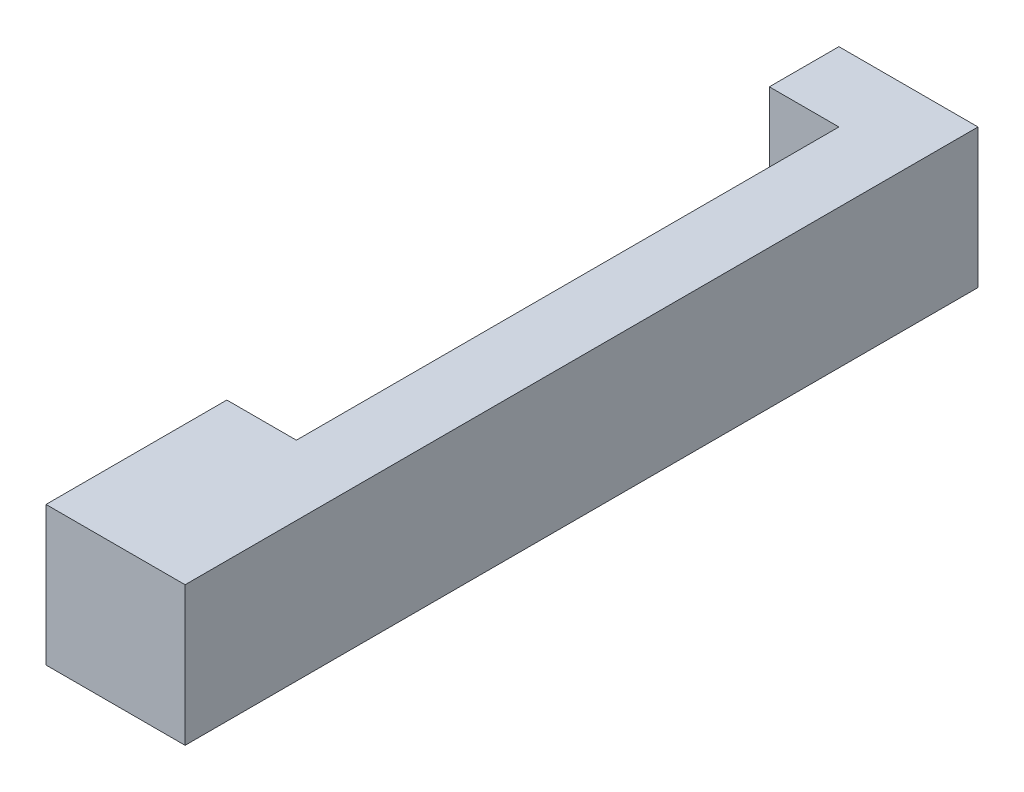
ISO-10303-21;
HEADER;
FILE_DESCRIPTION(('STEP AP214'),'2;1');
FILE_NAME('part.step','',(''),(''),'','','');
FILE_SCHEMA(('AUTOMOTIVE_DESIGN { 1 0 10303 214 1 1 1 1 }'));
ENDSEC;
DATA;
#1=APPLICATION_CONTEXT('core data for automotive mechanical design processes');
#2=APPLICATION_PROTOCOL_DEFINITION('international standard','automotive_design',2000,#1);
#3=PRODUCT_CONTEXT('',#1,'mechanical');
#4=PRODUCT('Part','Part','',(#3));
#5=PRODUCT_RELATED_PRODUCT_CATEGORY('part','',(#4));
#6=PRODUCT_DEFINITION_FORMATION('','',#4);
#7=PRODUCT_DEFINITION_CONTEXT('part definition',#1,'design');
#8=PRODUCT_DEFINITION('design','',#6,#7);
#9=PRODUCT_DEFINITION_SHAPE('','',#8);
#10=(LENGTH_UNIT() NAMED_UNIT(*) SI_UNIT(.MILLI.,.METRE.));
#11=(NAMED_UNIT(*) PLANE_ANGLE_UNIT() SI_UNIT($,.RADIAN.));
#12=(NAMED_UNIT(*) SI_UNIT($,.STERADIAN.) SOLID_ANGLE_UNIT());
#13=UNCERTAINTY_MEASURE_WITH_UNIT(LENGTH_MEASURE(1.E-05),#10,'distance_accuracy_value','');
#14=(GEOMETRIC_REPRESENTATION_CONTEXT(3) GLOBAL_UNCERTAINTY_ASSIGNED_CONTEXT((#13)) GLOBAL_UNIT_ASSIGNED_CONTEXT((#10,
#11,#12)) REPRESENTATION_CONTEXT('',''));
#15=CARTESIAN_POINT('',(0.,0.,0.));
#16=DIRECTION('',(0.,0.,1.));
#17=DIRECTION('',(1.,0.,0.));
#18=AXIS2_PLACEMENT_3D('',#15,#16,#17);
#19=CARTESIAN_POINT('',(0.,25.4,0.));
#20=DIRECTION('',(0.,0.,1.));
#21=DIRECTION('',(1.,0.,0.));
#22=AXIS2_PLACEMENT_3D('',#19,#20,#21);
#23=PLANE('',#22);
#24=DIRECTION('',(-1.,0.,0.));
#25=VECTOR('',#24,1.);
#26=CARTESIAN_POINT('',(0.,0.,0.));
#27=LINE('',#26,#25);
#28=CARTESIAN_POINT('',(0.,0.,0.));
#29=VERTEX_POINT('',#28);
#30=CARTESIAN_POINT('',(-25.4,0.,0.));
#31=VERTEX_POINT('',#30);
#32=EDGE_CURVE('E179',#29,#31,#27,.T.);
#33=ORIENTED_EDGE('',*,*,#32,.F.);
#34=DIRECTION('',(0.,-1.,0.));
#35=VECTOR('',#34,1.);
#36=CARTESIAN_POINT('',(0.,25.4,0.));
#37=LINE('',#36,#35);
#38=CARTESIAN_POINT('',(0.,25.4,0.));
#39=VERTEX_POINT('',#38);
#40=EDGE_CURVE('E154',#39,#29,#37,.T.);
#41=ORIENTED_EDGE('',*,*,#40,.F.);
#42=DIRECTION('',(-1.,0.,0.));
#43=VECTOR('',#42,1.);
#44=CARTESIAN_POINT('',(0.,25.4,0.));
#45=LINE('',#44,#43);
#46=CARTESIAN_POINT('',(-25.4,25.4,0.));
#47=VERTEX_POINT('',#46);
#48=EDGE_CURVE('E199',#39,#47,#45,.T.);
#49=ORIENTED_EDGE('',*,*,#48,.T.);
#50=DIRECTION('',(0.,-1.,0.));
#51=VECTOR('',#50,1.);
#52=CARTESIAN_POINT('',(-25.4,25.4,0.));
#53=LINE('',#52,#51);
#54=EDGE_CURVE('E86',#47,#31,#53,.T.);
#55=ORIENTED_EDGE('',*,*,#54,.T.);
#56=EDGE_LOOP('',(#33,#41,#49,#55));
#57=FACE_BOUND('',#56,.T.);
#58=ADVANCED_FACE('F75',(#57),#23,.T.);
#59=CARTESIAN_POINT('',(0.,25.4,0.));
#60=DIRECTION('',(-1.,0.,0.));
#61=DIRECTION('',(0.,0.,1.));
#62=AXIS2_PLACEMENT_3D('',#59,#60,#61);
#63=PLANE('',#62);
#64=DIRECTION('',(0.,0.,-1.));
#65=VECTOR('',#64,1.);
#66=CARTESIAN_POINT('',(0.,0.,0.));
#67=LINE('',#66,#65);
#68=CARTESIAN_POINT('',(0.,0.,-144.78));
#69=VERTEX_POINT('',#68);
#70=EDGE_CURVE('E128',#29,#69,#67,.T.);
#71=ORIENTED_EDGE('',*,*,#70,.T.);
#72=DIRECTION('',(0.,-1.,0.));
#73=VECTOR('',#72,1.);
#74=CARTESIAN_POINT('',(0.,25.4,-144.78));
#75=LINE('',#74,#73);
#76=CARTESIAN_POINT('',(0.,25.4,-144.78));
#77=VERTEX_POINT('',#76);
#78=EDGE_CURVE('E122',#77,#69,#75,.T.);
#79=ORIENTED_EDGE('',*,*,#78,.F.);
#80=DIRECTION('',(0.,0.,-1.));
#81=VECTOR('',#80,1.);
#82=CARTESIAN_POINT('',(0.,25.4,0.));
#83=LINE('',#82,#81);
#84=EDGE_CURVE('E195',#39,#77,#83,.T.);
#85=ORIENTED_EDGE('',*,*,#84,.F.);
#86=ORIENTED_EDGE('',*,*,#40,.T.);
#87=EDGE_LOOP('',(#71,#79,#85,#86));
#88=FACE_BOUND('',#87,.T.);
#89=ADVANCED_FACE('F230',(#88),#63,.F.);
#90=CARTESIAN_POINT('',(0.,25.4,-144.78));
#91=DIRECTION('',(0.,0.,1.));
#92=DIRECTION('',(1.,0.,0.));
#93=AXIS2_PLACEMENT_3D('',#90,#91,#92);
#94=PLANE('',#93);
#95=DIRECTION('',(-1.,0.,0.));
#96=VECTOR('',#95,1.);
#97=CARTESIAN_POINT('',(0.,0.,-144.78));
#98=LINE('',#97,#96);
#99=CARTESIAN_POINT('',(-25.4,0.,-144.78));
#100=VERTEX_POINT('',#99);
#101=EDGE_CURVE('E114',#69,#100,#98,.T.);
#102=ORIENTED_EDGE('',*,*,#101,.T.);
#103=DIRECTION('',(0.,-1.,0.));
#104=VECTOR('',#103,1.);
#105=CARTESIAN_POINT('',(-25.4,25.4,-144.78));
#106=LINE('',#105,#104);
#107=CARTESIAN_POINT('',(-25.4,25.4,-144.78));
#108=VERTEX_POINT('',#107);
#109=EDGE_CURVE('E118',#108,#100,#106,.T.);
#110=ORIENTED_EDGE('',*,*,#109,.F.);
#111=DIRECTION('',(-1.,0.,0.));
#112=VECTOR('',#111,1.);
#113=CARTESIAN_POINT('',(0.,25.4,-144.78));
#114=LINE('',#113,#112);
#115=EDGE_CURVE('E192',#77,#108,#114,.T.);
#116=ORIENTED_EDGE('',*,*,#115,.F.);
#117=ORIENTED_EDGE('',*,*,#78,.T.);
#118=EDGE_LOOP('',(#102,#110,#116,#117));
#119=FACE_BOUND('',#118,.T.);
#120=ADVANCED_FACE('F116',(#119),#94,.F.);
#121=CARTESIAN_POINT('',(-12.7,25.4,0.));
#122=DIRECTION('',(-1.,0.,0.));
#123=DIRECTION('',(0.,0.,1.));
#124=AXIS2_PLACEMENT_3D('',#121,#122,#123);
#125=PLANE('',#124);
#126=DIRECTION('',(0.,1.,0.));
#127=VECTOR('',#126,1.);
#128=CARTESIAN_POINT('',(-12.7,25.4,-132.08));
#129=LINE('',#128,#127);
#130=CARTESIAN_POINT('',(-12.7,0.,-132.08));
#131=VERTEX_POINT('',#130);
#132=CARTESIAN_POINT('',(-12.7,25.4,-132.08));
#133=VERTEX_POINT('',#132);
#134=EDGE_CURVE('E12',#131,#133,#129,.T.);
#135=ORIENTED_EDGE('',*,*,#134,.F.);
#136=DIRECTION('',(0.,0.,-1.));
#137=VECTOR('',#136,1.);
#138=CARTESIAN_POINT('',(-12.7,0.,0.));
#139=LINE('',#138,#137);
#140=CARTESIAN_POINT('',(-12.7,0.,-33.02));
#141=VERTEX_POINT('',#140);
#142=EDGE_CURVE('E127',#141,#131,#139,.T.);
#143=ORIENTED_EDGE('',*,*,#142,.F.);
#144=DIRECTION('',(0.,-1.,0.));
#145=VECTOR('',#144,1.);
#146=CARTESIAN_POINT('',(-12.7,25.4,-33.02));
#147=LINE('',#146,#145);
#148=CARTESIAN_POINT('',(-12.7,25.4,-33.02));
#149=VERTEX_POINT('',#148);
#150=EDGE_CURVE('E160',#149,#141,#147,.T.);
#151=ORIENTED_EDGE('',*,*,#150,.F.);
#152=DIRECTION('',(0.,0.,-1.));
#153=VECTOR('',#152,1.);
#154=CARTESIAN_POINT('',(-12.7,25.4,0.));
#155=LINE('',#154,#153);
#156=EDGE_CURVE('E188',#149,#133,#155,.T.);
#157=ORIENTED_EDGE('',*,*,#156,.T.);
#158=EDGE_LOOP('',(#135,#143,#151,#157));
#159=FACE_BOUND('',#158,.T.);
#160=ADVANCED_FACE('F244',(#159),#125,.T.);
#161=CARTESIAN_POINT('',(0.,25.4,-33.02));
#162=DIRECTION('',(0.,0.,1.));
#163=DIRECTION('',(1.,0.,0.));
#164=AXIS2_PLACEMENT_3D('',#161,#162,#163);
#165=PLANE('',#164);
#166=DIRECTION('',(-1.,0.,0.));
#167=VECTOR('',#166,1.);
#168=CARTESIAN_POINT('',(0.,0.,-33.02));
#169=LINE('',#168,#167);
#170=CARTESIAN_POINT('',(-25.4,0.,-33.02));
#171=VERTEX_POINT('',#170);
#172=EDGE_CURVE('E169',#141,#171,#169,.T.);
#173=ORIENTED_EDGE('',*,*,#172,.T.);
#174=DIRECTION('',(0.,-1.,0.));
#175=VECTOR('',#174,1.);
#176=CARTESIAN_POINT('',(-25.4,25.4,-33.02));
#177=LINE('',#176,#175);
#178=CARTESIAN_POINT('',(-25.4,25.4,-33.02));
#179=VERTEX_POINT('',#178);
#180=EDGE_CURVE('E164',#179,#171,#177,.T.);
#181=ORIENTED_EDGE('',*,*,#180,.F.);
#182=DIRECTION('',(-1.,0.,0.));
#183=VECTOR('',#182,1.);
#184=CARTESIAN_POINT('',(0.,25.4,-33.02));
#185=LINE('',#184,#183);
#186=EDGE_CURVE('E168',#149,#179,#185,.T.);
#187=ORIENTED_EDGE('',*,*,#186,.F.);
#188=ORIENTED_EDGE('',*,*,#150,.T.);
#189=EDGE_LOOP('',(#173,#181,#187,#188));
#190=FACE_BOUND('',#189,.T.);
#191=ADVANCED_FACE('F241',(#190),#165,.F.);
#192=CARTESIAN_POINT('',(-25.4,25.4,0.));
#193=DIRECTION('',(-1.,0.,0.));
#194=DIRECTION('',(0.,0.,1.));
#195=AXIS2_PLACEMENT_3D('',#192,#193,#194);
#196=PLANE('',#195);
#197=DIRECTION('',(0.,0.,-1.));
#198=VECTOR('',#197,1.);
#199=CARTESIAN_POINT('',(-25.4,0.,0.));
#200=LINE('',#199,#198);
#201=EDGE_CURVE('E136',#31,#171,#200,.T.);
#202=ORIENTED_EDGE('',*,*,#201,.F.);
#203=ORIENTED_EDGE('',*,*,#54,.F.);
#204=DIRECTION('',(0.,0.,-1.));
#205=VECTOR('',#204,1.);
#206=CARTESIAN_POINT('',(-25.4,25.4,0.));
#207=LINE('',#206,#205);
#208=EDGE_CURVE('E173',#47,#179,#207,.T.);
#209=ORIENTED_EDGE('',*,*,#208,.T.);
#210=ORIENTED_EDGE('',*,*,#180,.T.);
#211=EDGE_LOOP('',(#202,#203,#209,#210));
#212=FACE_BOUND('',#211,.T.);
#213=ADVANCED_FACE('F209',(#212),#196,.T.);
#214=CARTESIAN_POINT('',(0.,0.,0.));
#215=DIRECTION('',(0.,1.,0.));
#216=DIRECTION('',(0.,0.,1.));
#217=AXIS2_PLACEMENT_3D('',#214,#215,#216);
#218=PLANE('',#217);
#219=ORIENTED_EDGE('',*,*,#201,.T.);
#220=ORIENTED_EDGE('',*,*,#172,.F.);
#221=ORIENTED_EDGE('',*,*,#142,.T.);
#222=DIRECTION('',(-1.,0.,0.));
#223=VECTOR('',#222,1.);
#224=CARTESIAN_POINT('',(-12.7,0.,-132.08));
#225=LINE('',#224,#223);
#226=CARTESIAN_POINT('',(-25.4,0.,-132.08));
#227=VERTEX_POINT('',#226);
#228=EDGE_CURVE('E140',#131,#227,#225,.T.);
#229=ORIENTED_EDGE('',*,*,#228,.T.);
#230=DIRECTION('',(0.,0.,1.));
#231=VECTOR('',#230,1.);
#232=CARTESIAN_POINT('',(-25.4,0.,-144.78));
#233=LINE('',#232,#231);
#234=EDGE_CURVE('E132',#100,#227,#233,.T.);
#235=ORIENTED_EDGE('',*,*,#234,.F.);
#236=ORIENTED_EDGE('',*,*,#101,.F.);
#237=ORIENTED_EDGE('',*,*,#70,.F.);
#238=ORIENTED_EDGE('',*,*,#32,.T.);
#239=EDGE_LOOP('',(#219,#220,#221,#229,#235,#236,#237,#238));
#240=FACE_BOUND('',#239,.T.);
#241=ADVANCED_FACE('F138',(#240),#218,.F.);
#242=CARTESIAN_POINT('',(0.,25.4,0.));
#243=DIRECTION('',(0.,1.,0.));
#244=DIRECTION('',(0.,0.,1.));
#245=AXIS2_PLACEMENT_3D('',#242,#243,#244);
#246=PLANE('',#245);
#247=ORIENTED_EDGE('',*,*,#208,.F.);
#248=ORIENTED_EDGE('',*,*,#48,.F.);
#249=ORIENTED_EDGE('',*,*,#84,.T.);
#250=ORIENTED_EDGE('',*,*,#115,.T.);
#251=DIRECTION('',(0.,0.,1.));
#252=VECTOR('',#251,1.);
#253=CARTESIAN_POINT('',(-25.4,25.4,-144.78));
#254=LINE('',#253,#252);
#255=CARTESIAN_POINT('',(-25.4,25.4,-132.08));
#256=VERTEX_POINT('',#255);
#257=EDGE_CURVE('E134',#108,#256,#254,.T.);
#258=ORIENTED_EDGE('',*,*,#257,.T.);
#259=DIRECTION('',(-1.,0.,0.));
#260=VECTOR('',#259,1.);
#261=CARTESIAN_POINT('',(-12.7,25.4,-132.08));
#262=LINE('',#261,#260);
#263=EDGE_CURVE('E142',#133,#256,#262,.T.);
#264=ORIENTED_EDGE('',*,*,#263,.F.);
#265=ORIENTED_EDGE('',*,*,#156,.F.);
#266=ORIENTED_EDGE('',*,*,#186,.T.);
#267=EDGE_LOOP('',(#247,#248,#249,#250,#258,#264,#265,#266));
#268=FACE_BOUND('',#267,.T.);
#269=ADVANCED_FACE('F217',(#268),#246,.T.);
#270=CARTESIAN_POINT('',(-25.4,25.4,-144.78));
#271=DIRECTION('',(1.,0.,0.));
#272=DIRECTION('',(0.,0.,-1.));
#273=AXIS2_PLACEMENT_3D('',#270,#271,#272);
#274=PLANE('',#273);
#275=ORIENTED_EDGE('',*,*,#234,.T.);
#276=DIRECTION('',(0.,-1.,0.));
#277=VECTOR('',#276,1.);
#278=CARTESIAN_POINT('',(-25.4,25.4,-132.08));
#279=LINE('',#278,#277);
#280=EDGE_CURVE('E79',#256,#227,#279,.T.);
#281=ORIENTED_EDGE('',*,*,#280,.F.);
#282=ORIENTED_EDGE('',*,*,#257,.F.);
#283=ORIENTED_EDGE('',*,*,#109,.T.);
#284=EDGE_LOOP('',(#275,#281,#282,#283));
#285=FACE_BOUND('',#284,.T.);
#286=ADVANCED_FACE('F131',(#285),#274,.F.);
#287=CARTESIAN_POINT('',(-12.7,25.4,-132.08));
#288=DIRECTION('',(0.,0.,1.));
#289=DIRECTION('',(1.,0.,0.));
#290=AXIS2_PLACEMENT_3D('',#287,#288,#289);
#291=PLANE('',#290);
#292=ORIENTED_EDGE('',*,*,#228,.F.);
#293=ORIENTED_EDGE('',*,*,#134,.T.);
#294=ORIENTED_EDGE('',*,*,#263,.T.);
#295=ORIENTED_EDGE('',*,*,#280,.T.);
#296=EDGE_LOOP('',(#292,#293,#294,#295));
#297=FACE_BOUND('',#296,.T.);
#298=ADVANCED_FACE('F77',(#297),#291,.T.);
#299=CLOSED_SHELL('',(#58,#89,#120,#160,#191,#213,#241,#269,#286,#298));
#300=MANIFOLD_SOLID_BREP('B2',#299);
#301=ADVANCED_BREP_SHAPE_REPRESENTATION('',(#18,#300),#14);
#302=SHAPE_DEFINITION_REPRESENTATION(#9,#301);
ENDSEC;
END-ISO-10303-21;
